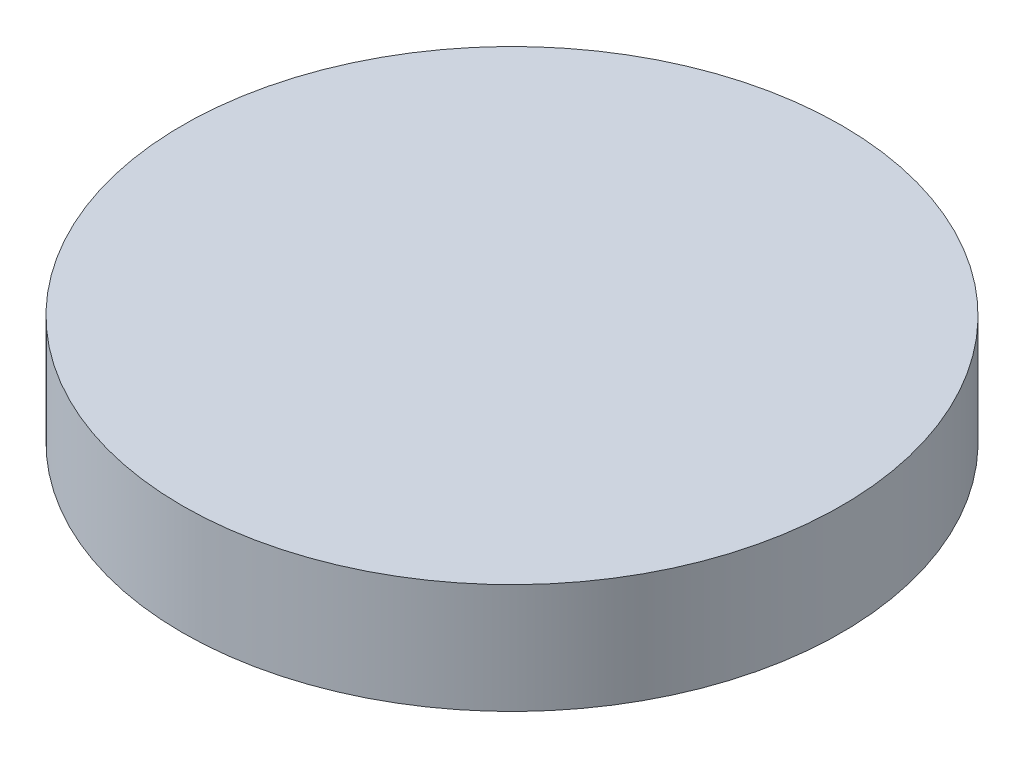
ISO-10303-21;
HEADER;
FILE_DESCRIPTION(('STEP AP214'),'2;1');
FILE_NAME('part.step','',(''),(''),'','','');
FILE_SCHEMA(('AUTOMOTIVE_DESIGN { 1 0 10303 214 1 1 1 1 }'));
ENDSEC;
DATA;
#1=APPLICATION_CONTEXT('core data for automotive mechanical design processes');
#2=APPLICATION_PROTOCOL_DEFINITION('international standard','automotive_design',2000,#1);
#3=PRODUCT_CONTEXT('',#1,'mechanical');
#4=PRODUCT('Part','Part','',(#3));
#5=PRODUCT_RELATED_PRODUCT_CATEGORY('part','',(#4));
#6=PRODUCT_DEFINITION_FORMATION('','',#4);
#7=PRODUCT_DEFINITION_CONTEXT('part definition',#1,'design');
#8=PRODUCT_DEFINITION('design','',#6,#7);
#9=PRODUCT_DEFINITION_SHAPE('','',#8);
#10=(LENGTH_UNIT() NAMED_UNIT(*) SI_UNIT(.MILLI.,.METRE.));
#11=(NAMED_UNIT(*) PLANE_ANGLE_UNIT() SI_UNIT($,.RADIAN.));
#12=(NAMED_UNIT(*) SI_UNIT($,.STERADIAN.) SOLID_ANGLE_UNIT());
#13=UNCERTAINTY_MEASURE_WITH_UNIT(LENGTH_MEASURE(1.E-05),#10,'distance_accuracy_value','');
#14=(GEOMETRIC_REPRESENTATION_CONTEXT(3) GLOBAL_UNCERTAINTY_ASSIGNED_CONTEXT((#13)) GLOBAL_UNIT_ASSIGNED_CONTEXT((#10,
#11,#12)) REPRESENTATION_CONTEXT('',''));
#15=CARTESIAN_POINT('',(0.,0.,0.));
#16=DIRECTION('',(0.,0.,1.));
#17=DIRECTION('',(1.,0.,0.));
#18=AXIS2_PLACEMENT_3D('',#15,#16,#17);
#19=CARTESIAN_POINT('',(-47.7087835944729,6.35,19.3270117308941));
#20=DIRECTION('',(0.,-1.,0.));
#21=DIRECTION('',(0.,0.,-1.));
#22=AXIS2_PLACEMENT_3D('',#19,#20,#21);
#23=CYLINDRICAL_SURFACE('',#22,19.05);
#24=CARTESIAN_POINT('',(-47.7087835944729,6.35,19.3270117308941));
#25=DIRECTION('',(0.,1.,0.));
#26=DIRECTION('',(0.,0.,1.));
#27=AXIS2_PLACEMENT_3D('',#24,#25,#26);
#28=CIRCLE('',#27,19.05);
#29=CARTESIAN_POINT('',(-47.7087835944729,6.35,38.3770117308941));
#30=VERTEX_POINT('',#29);
#31=EDGE_CURVE('E10',#30,#30,#28,.T.);
#32=ORIENTED_EDGE('',*,*,#31,.F.);
#33=EDGE_LOOP('',(#32));
#34=FACE_BOUND('',#33,.T.);
#35=CARTESIAN_POINT('',(-47.7087835944729,0.,19.3270117308941));
#36=DIRECTION('',(0.,1.,0.));
#37=DIRECTION('',(0.,0.,1.));
#38=AXIS2_PLACEMENT_3D('',#35,#36,#37);
#39=CIRCLE('',#38,19.05);
#40=CARTESIAN_POINT('',(-47.7087835944729,0.,38.3770117308941));
#41=VERTEX_POINT('',#40);
#42=EDGE_CURVE('E33',#41,#41,#39,.T.);
#43=ORIENTED_EDGE('',*,*,#42,.T.);
#44=EDGE_LOOP('',(#43));
#45=FACE_BOUND('',#44,.T.);
#46=ADVANCED_FACE('F30',(#34,#45),#23,.T.);
#47=CARTESIAN_POINT('',(-47.7087835944729,6.35,19.3270117308941));
#48=DIRECTION('',(0.,1.,0.));
#49=DIRECTION('',(0.,0.,1.));
#50=AXIS2_PLACEMENT_3D('',#47,#48,#49);
#51=PLANE('',#50);
#52=ORIENTED_EDGE('',*,*,#31,.T.);
#53=EDGE_LOOP('',(#52));
#54=FACE_BOUND('',#53,.T.);
#55=ADVANCED_FACE('F45',(#54),#51,.T.);
#56=CARTESIAN_POINT('',(-47.7087835944729,0.,19.3270117308941));
#57=DIRECTION('',(0.,1.,0.));
#58=DIRECTION('',(0.,0.,1.));
#59=AXIS2_PLACEMENT_3D('',#56,#57,#58);
#60=PLANE('',#59);
#61=ORIENTED_EDGE('',*,*,#42,.F.);
#62=EDGE_LOOP('',(#61));
#63=FACE_BOUND('',#62,.T.);
#64=ADVANCED_FACE('F43',(#63),#60,.F.);
#65=CLOSED_SHELL('',(#46,#55,#64));
#66=MANIFOLD_SOLID_BREP('B2',#65);
#67=ADVANCED_BREP_SHAPE_REPRESENTATION('',(#18,#66),#14);
#68=SHAPE_DEFINITION_REPRESENTATION(#9,#67);
ENDSEC;
END-ISO-10303-21;
